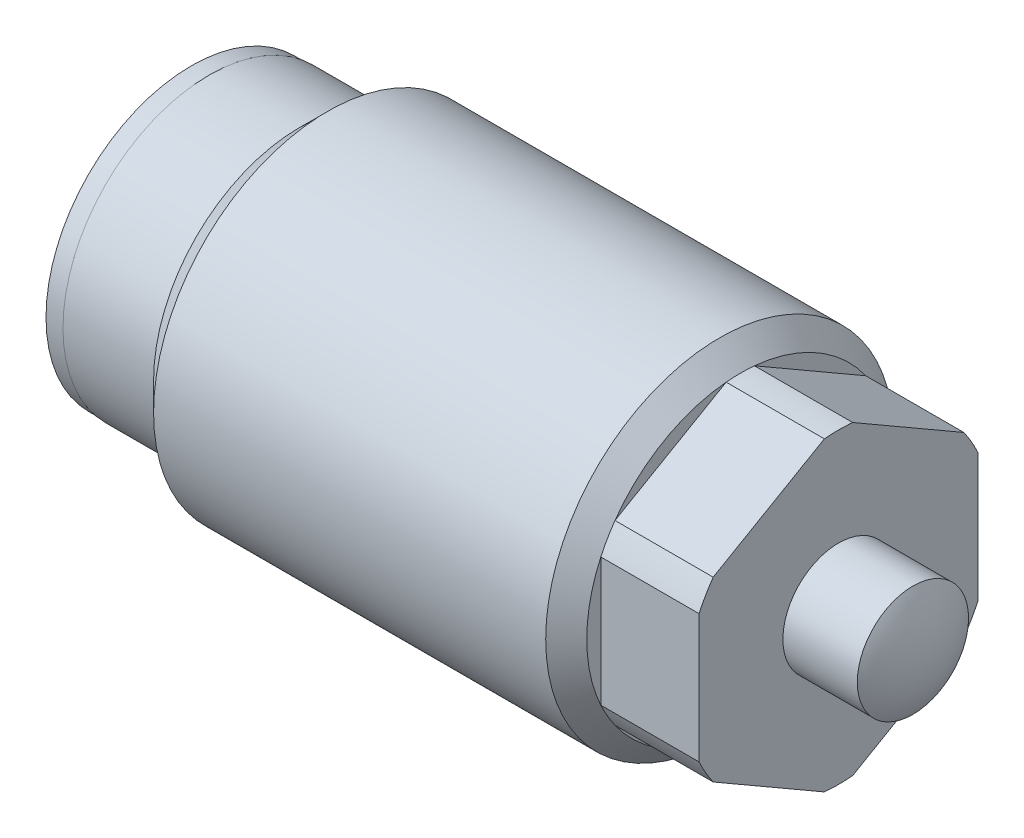
ISO-10303-21;
HEADER;
FILE_DESCRIPTION(('STEP AP214'),'2;1');
FILE_NAME('part.step','',(''),(''),'','','');
FILE_SCHEMA(('AUTOMOTIVE_DESIGN { 1 0 10303 214 1 1 1 1 }'));
ENDSEC;
DATA;
#1=APPLICATION_CONTEXT('core data for automotive mechanical design processes');
#2=APPLICATION_PROTOCOL_DEFINITION('international standard','automotive_design',2000,#1);
#3=PRODUCT_CONTEXT('',#1,'mechanical');
#4=PRODUCT('Part','Part','',(#3));
#5=PRODUCT_RELATED_PRODUCT_CATEGORY('part','',(#4));
#6=PRODUCT_DEFINITION_FORMATION('','',#4);
#7=PRODUCT_DEFINITION_CONTEXT('part definition',#1,'design');
#8=PRODUCT_DEFINITION('design','',#6,#7);
#9=PRODUCT_DEFINITION_SHAPE('','',#8);
#10=(LENGTH_UNIT() NAMED_UNIT(*) SI_UNIT(.MILLI.,.METRE.));
#11=(NAMED_UNIT(*) PLANE_ANGLE_UNIT() SI_UNIT($,.RADIAN.));
#12=(NAMED_UNIT(*) SI_UNIT($,.STERADIAN.) SOLID_ANGLE_UNIT());
#13=UNCERTAINTY_MEASURE_WITH_UNIT(LENGTH_MEASURE(1.E-05),#10,'distance_accuracy_value','');
#14=(GEOMETRIC_REPRESENTATION_CONTEXT(3) GLOBAL_UNCERTAINTY_ASSIGNED_CONTEXT((#13)) GLOBAL_UNIT_ASSIGNED_CONTEXT((#10,
#11,#12)) REPRESENTATION_CONTEXT('',''));
#15=CARTESIAN_POINT('',(0.,0.,0.));
#16=DIRECTION('',(0.,0.,1.));
#17=DIRECTION('',(1.,0.,0.));
#18=AXIS2_PLACEMENT_3D('',#15,#16,#17);
#19=CARTESIAN_POINT('',(30.226,9.906,0.));
#20=DIRECTION('',(1.,0.,0.));
#21=DIRECTION('',(0.,0.,-1.));
#22=AXIS2_PLACEMENT_3D('',#19,#20,#21);
#23=PLANE('',#22);
#24=DIRECTION('',(0.,-0.5,-0.866025403784439));
#25=VECTOR('',#24,1.);
#26=CARTESIAN_POINT('',(30.226,-4.58271776169266,7.9375));
#27=LINE('',#26,#25);
#28=CARTESIAN_POINT('',(30.226,-5.04775879574999,7.13202530140833));
#29=VERTEX_POINT('',#28);
#30=CARTESIAN_POINT('',(30.226,-8.70039448932798,0.805474698591668));
#31=VERTEX_POINT('',#30);
#32=EDGE_CURVE('E186',#29,#31,#27,.T.);
#33=ORIENTED_EDGE('',*,*,#32,.F.);
#34=CARTESIAN_POINT('',(30.226,0.,0.));
#35=DIRECTION('',(1.,0.,0.));
#36=DIRECTION('',(0.,0.,-1.));
#37=AXIS2_PLACEMENT_3D('',#34,#35,#36);
#38=CIRCLE('',#37,8.73759999999999);
#39=EDGE_CURVE('E12',#29,#31,#38,.T.);
#40=ORIENTED_EDGE('',*,*,#39,.T.);
#41=EDGE_LOOP('',(#33,#40));
#42=FACE_BOUND('',#41,.T.);
#43=ADVANCED_FACE('F41',(#42),#23,.T.);
#44=DIRECTION('',(0.,0.5,-0.866025403784439));
#45=VECTOR('',#44,1.);
#46=CARTESIAN_POINT('',(30.226,-9.16543552338531,0.));
#47=LINE('',#46,#45);
#48=CARTESIAN_POINT('',(30.226,-8.70039448932798,-0.805474698591672));
#49=VERTEX_POINT('',#48);
#50=CARTESIAN_POINT('',(30.226,-5.04775879574999,-7.13202530140833));
#51=VERTEX_POINT('',#50);
#52=EDGE_CURVE('E184',#49,#51,#47,.T.);
#53=ORIENTED_EDGE('',*,*,#52,.F.);
#54=CARTESIAN_POINT('',(30.226,0.,0.));
#55=DIRECTION('',(1.,0.,0.));
#56=DIRECTION('',(0.,0.,-1.));
#57=AXIS2_PLACEMENT_3D('',#54,#55,#56);
#58=CIRCLE('',#57,8.73759999999999);
#59=EDGE_CURVE('E49',#49,#51,#58,.T.);
#60=ORIENTED_EDGE('',*,*,#59,.T.);
#61=EDGE_LOOP('',(#53,#60));
#62=FACE_BOUND('',#61,.T.);
#63=ADVANCED_FACE('F285',(#62),#23,.T.);
#64=DIRECTION('',(0.,1.,0.));
#65=VECTOR('',#64,1.);
#66=CARTESIAN_POINT('',(30.226,-4.58271776169266,-7.9375));
#67=LINE('',#66,#65);
#68=CARTESIAN_POINT('',(30.226,-3.65263569357799,-7.9375));
#69=VERTEX_POINT('',#68);
#70=CARTESIAN_POINT('',(30.226,3.65263569357799,-7.9375));
#71=VERTEX_POINT('',#70);
#72=EDGE_CURVE('E144',#69,#71,#67,.T.);
#73=ORIENTED_EDGE('',*,*,#72,.F.);
#74=CARTESIAN_POINT('',(30.226,0.,0.));
#75=DIRECTION('',(1.,0.,0.));
#76=DIRECTION('',(0.,0.,-1.));
#77=AXIS2_PLACEMENT_3D('',#74,#75,#76);
#78=CIRCLE('',#77,8.73759999999999);
#79=EDGE_CURVE('E153',#69,#71,#78,.T.);
#80=ORIENTED_EDGE('',*,*,#79,.T.);
#81=EDGE_LOOP('',(#73,#80));
#82=FACE_BOUND('',#81,.T.);
#83=ADVANCED_FACE('F152',(#82),#23,.T.);
#84=DIRECTION('',(0.,0.5,0.866025403784438));
#85=VECTOR('',#84,1.);
#86=CARTESIAN_POINT('',(30.226,4.58271776169265,-7.9375));
#87=LINE('',#86,#85);
#88=CARTESIAN_POINT('',(30.226,5.04775879574999,-7.13202530140834));
#89=VERTEX_POINT('',#88);
#90=CARTESIAN_POINT('',(30.226,8.70039448932798,-0.805474698591672));
#91=VERTEX_POINT('',#90);
#92=EDGE_CURVE('E155',#89,#91,#87,.T.);
#93=ORIENTED_EDGE('',*,*,#92,.F.);
#94=CARTESIAN_POINT('',(30.226,0.,0.));
#95=DIRECTION('',(1.,0.,0.));
#96=DIRECTION('',(0.,0.,-1.));
#97=AXIS2_PLACEMENT_3D('',#94,#95,#96);
#98=CIRCLE('',#97,8.73759999999999);
#99=EDGE_CURVE('E160',#89,#91,#98,.T.);
#100=ORIENTED_EDGE('',*,*,#99,.T.);
#101=EDGE_LOOP('',(#93,#100));
#102=FACE_BOUND('',#101,.T.);
#103=ADVANCED_FACE('F327',(#102),#23,.T.);
#104=DIRECTION('',(0.,-0.5,0.866025403784439));
#105=VECTOR('',#104,1.);
#106=CARTESIAN_POINT('',(30.226,9.16543552338531,0.));
#107=LINE('',#106,#105);
#108=CARTESIAN_POINT('',(30.226,8.70039448932798,0.80547469859167));
#109=VERTEX_POINT('',#108);
#110=CARTESIAN_POINT('',(30.226,5.04775879574999,7.13202530140833));
#111=VERTEX_POINT('',#110);
#112=EDGE_CURVE('E192',#109,#111,#107,.T.);
#113=ORIENTED_EDGE('',*,*,#112,.F.);
#114=CARTESIAN_POINT('',(30.226,0.,0.));
#115=DIRECTION('',(1.,0.,0.));
#116=DIRECTION('',(0.,0.,-1.));
#117=AXIS2_PLACEMENT_3D('',#114,#115,#116);
#118=CIRCLE('',#117,8.73759999999999);
#119=EDGE_CURVE('E162',#109,#111,#118,.T.);
#120=ORIENTED_EDGE('',*,*,#119,.T.);
#121=EDGE_LOOP('',(#113,#120));
#122=FACE_BOUND('',#121,.T.);
#123=ADVANCED_FACE('F299',(#122),#23,.T.);
#124=CARTESIAN_POINT('',(35.814,13.748153285078,-7.9375));
#125=DIRECTION('',(1.,0.,0.));
#126=DIRECTION('',(0.,0.,-1.));
#127=AXIS2_PLACEMENT_3D('',#124,#125,#126);
#128=PLANE('',#127);
#129=CARTESIAN_POINT('',(35.814,0.,0.));
#130=DIRECTION('',(-1.,0.,0.));
#131=DIRECTION('',(0.,-1.,0.));
#132=AXIS2_PLACEMENT_3D('',#129,#130,#131);
#133=CIRCLE('',#132,3.16484);
#134=CARTESIAN_POINT('',(35.814,-3.16484,0.));
#135=VERTEX_POINT('',#134);
#136=EDGE_CURVE('E156',#135,#135,#133,.T.);
#137=ORIENTED_EDGE('',*,*,#136,.T.);
#138=EDGE_LOOP('',(#137));
#139=FACE_BOUND('',#138,.T.);
#140=DIRECTION('',(0.,1.,0.));
#141=VECTOR('',#140,1.);
#142=CARTESIAN_POINT('',(35.814,-4.58271776169266,-7.9375));
#143=LINE('',#142,#141);
#144=CARTESIAN_POINT('',(35.814,-3.65263569357799,-7.9375));
#145=VERTEX_POINT('',#144);
#146=CARTESIAN_POINT('',(35.814,3.65263569357799,-7.9375));
#147=VERTEX_POINT('',#146);
#148=EDGE_CURVE('E147',#145,#147,#143,.T.);
#149=ORIENTED_EDGE('',*,*,#148,.T.);
#150=CARTESIAN_POINT('',(35.814,0.,0.));
#151=DIRECTION('',(1.,0.,0.));
#152=DIRECTION('',(0.,0.,-1.));
#153=AXIS2_PLACEMENT_3D('',#150,#151,#152);
#154=CIRCLE('',#153,8.7376);
#155=CARTESIAN_POINT('',(35.814,5.04775879574999,-7.13202530140833));
#156=VERTEX_POINT('',#155);
#157=EDGE_CURVE('E242',#147,#156,#154,.T.);
#158=ORIENTED_EDGE('',*,*,#157,.T.);
#159=DIRECTION('',(0.,0.5,0.866025403784438));
#160=VECTOR('',#159,1.);
#161=CARTESIAN_POINT('',(35.814,4.58271776169265,-7.9375));
#162=LINE('',#161,#160);
#163=CARTESIAN_POINT('',(35.814,8.70039448932798,-0.805474698591675));
#164=VERTEX_POINT('',#163);
#165=EDGE_CURVE('E208',#156,#164,#162,.T.);
#166=ORIENTED_EDGE('',*,*,#165,.T.);
#167=CARTESIAN_POINT('',(35.814,8.70039448932798,0.805474698591674));
#168=VERTEX_POINT('',#167);
#169=EDGE_CURVE('E244',#164,#168,#154,.T.);
#170=ORIENTED_EDGE('',*,*,#169,.T.);
#171=DIRECTION('',(0.,-0.5,0.866025403784439));
#172=VECTOR('',#171,1.);
#173=CARTESIAN_POINT('',(35.814,9.16543552338531,0.));
#174=LINE('',#173,#172);
#175=CARTESIAN_POINT('',(35.814,5.04775879575,7.13202530140833));
#176=VERTEX_POINT('',#175);
#177=EDGE_CURVE('E205',#168,#176,#174,.T.);
#178=ORIENTED_EDGE('',*,*,#177,.T.);
#179=CARTESIAN_POINT('',(35.814,3.652635693578,7.9375));
#180=VERTEX_POINT('',#179);
#181=EDGE_CURVE('E250',#176,#180,#154,.T.);
#182=ORIENTED_EDGE('',*,*,#181,.T.);
#183=DIRECTION('',(0.,-1.,0.));
#184=VECTOR('',#183,1.);
#185=CARTESIAN_POINT('',(35.814,4.58271776169266,7.9375));
#186=LINE('',#185,#184);
#187=CARTESIAN_POINT('',(35.814,-3.65263569357799,7.9375));
#188=VERTEX_POINT('',#187);
#189=EDGE_CURVE('E202',#180,#188,#186,.T.);
#190=ORIENTED_EDGE('',*,*,#189,.T.);
#191=CARTESIAN_POINT('',(35.814,-5.04775879574999,7.13202530140834));
#192=VERTEX_POINT('',#191);
#193=EDGE_CURVE('E253',#188,#192,#154,.T.);
#194=ORIENTED_EDGE('',*,*,#193,.T.);
#195=DIRECTION('',(0.,-0.5,-0.866025403784439));
#196=VECTOR('',#195,1.);
#197=CARTESIAN_POINT('',(35.814,-4.58271776169266,7.9375));
#198=LINE('',#197,#196);
#199=CARTESIAN_POINT('',(35.814,-8.70039448932798,0.805474698591664));
#200=VERTEX_POINT('',#199);
#201=EDGE_CURVE('E199',#192,#200,#198,.T.);
#202=ORIENTED_EDGE('',*,*,#201,.T.);
#203=CARTESIAN_POINT('',(35.814,-8.70039448932798,-0.805474698591664));
#204=VERTEX_POINT('',#203);
#205=EDGE_CURVE('E251',#200,#204,#154,.T.);
#206=ORIENTED_EDGE('',*,*,#205,.T.);
#207=DIRECTION('',(0.,0.5,-0.866025403784439));
#208=VECTOR('',#207,1.);
#209=CARTESIAN_POINT('',(35.814,-9.16543552338531,0.));
#210=LINE('',#209,#208);
#211=CARTESIAN_POINT('',(35.814,-5.04775879574999,-7.13202530140834));
#212=VERTEX_POINT('',#211);
#213=EDGE_CURVE('E183',#204,#212,#210,.T.);
#214=ORIENTED_EDGE('',*,*,#213,.T.);
#215=EDGE_CURVE('E245',#212,#145,#154,.T.);
#216=ORIENTED_EDGE('',*,*,#215,.T.);
#217=EDGE_LOOP('',(#149,#158,#166,#170,#178,#182,#190,#194,#202,#206,#214,#216));
#218=FACE_BOUND('',#217,.T.);
#219=ADVANCED_FACE('F259',(#139,#218),#128,.T.);
#220=CARTESIAN_POINT('',(35.814,-4.58271776169266,-7.9375));
#221=DIRECTION('',(0.,0.,1.));
#222=DIRECTION('',(1.,0.,0.));
#223=AXIS2_PLACEMENT_3D('',#220,#221,#222);
#224=PLANE('',#223);
#225=DIRECTION('',(1.,0.,0.));
#226=VECTOR('',#225,1.);
#227=CARTESIAN_POINT('',(2.20760090226423,-3.65263569357799,-7.9375));
#228=LINE('',#227,#226);
#229=EDGE_CURVE('E62',#69,#145,#228,.T.);
#230=ORIENTED_EDGE('',*,*,#229,.F.);
#231=ORIENTED_EDGE('',*,*,#72,.T.);
#232=DIRECTION('',(1.,0.,0.));
#233=VECTOR('',#232,1.);
#234=CARTESIAN_POINT('',(2.20760090226423,3.65263569357799,-7.9375));
#235=LINE('',#234,#233);
#236=EDGE_CURVE('E149',#147,#71,#235,.F.);
#237=ORIENTED_EDGE('',*,*,#236,.F.);
#238=ORIENTED_EDGE('',*,*,#148,.F.);
#239=EDGE_LOOP('',(#230,#231,#237,#238));
#240=FACE_BOUND('',#239,.T.);
#241=ADVANCED_FACE('F142',(#240),#224,.F.);
#242=CARTESIAN_POINT('',(35.814,4.58271776169265,-7.9375));
#243=DIRECTION('',(0.,-0.866025403784439,0.5));
#244=DIRECTION('',(0.,-0.5,-0.866025403784439));
#245=AXIS2_PLACEMENT_3D('',#242,#243,#244);
#246=PLANE('',#245);
#247=DIRECTION('',(1.,0.,0.));
#248=VECTOR('',#247,1.);
#249=CARTESIAN_POINT('',(2.20760090226423,5.04775879574999,-7.13202530140833));
#250=LINE('',#249,#248);
#251=EDGE_CURVE('E223',#89,#156,#250,.T.);
#252=ORIENTED_EDGE('',*,*,#251,.F.);
#253=ORIENTED_EDGE('',*,*,#92,.T.);
#254=DIRECTION('',(1.,0.,0.));
#255=VECTOR('',#254,1.);
#256=CARTESIAN_POINT('',(2.20760090226423,8.70039448932798,-0.805474698591675));
#257=LINE('',#256,#255);
#258=EDGE_CURVE('E225',#164,#91,#257,.F.);
#259=ORIENTED_EDGE('',*,*,#258,.F.);
#260=ORIENTED_EDGE('',*,*,#165,.F.);
#261=EDGE_LOOP('',(#252,#253,#259,#260));
#262=FACE_BOUND('',#261,.T.);
#263=ADVANCED_FACE('F341',(#262),#246,.F.);
#264=CARTESIAN_POINT('',(35.814,9.16543552338531,0.));
#265=DIRECTION('',(0.,-0.866025403784439,-0.5));
#266=DIRECTION('',(0.,0.5,-0.866025403784439));
#267=AXIS2_PLACEMENT_3D('',#264,#265,#266);
#268=PLANE('',#267);
#269=DIRECTION('',(1.,0.,0.));
#270=VECTOR('',#269,1.);
#271=CARTESIAN_POINT('',(2.20760090226423,8.70039448932798,0.805474698591674));
#272=LINE('',#271,#270);
#273=EDGE_CURVE('E228',#109,#168,#272,.T.);
#274=ORIENTED_EDGE('',*,*,#273,.F.);
#275=ORIENTED_EDGE('',*,*,#112,.T.);
#276=DIRECTION('',(1.,0.,0.));
#277=VECTOR('',#276,1.);
#278=CARTESIAN_POINT('',(2.20760090226423,5.04775879575,7.13202530140833));
#279=LINE('',#278,#277);
#280=EDGE_CURVE('E230',#176,#111,#279,.F.);
#281=ORIENTED_EDGE('',*,*,#280,.F.);
#282=ORIENTED_EDGE('',*,*,#177,.F.);
#283=EDGE_LOOP('',(#274,#275,#281,#282));
#284=FACE_BOUND('',#283,.T.);
#285=ADVANCED_FACE('F297',(#284),#268,.F.);
#286=CARTESIAN_POINT('',(35.814,4.58271776169266,7.9375));
#287=DIRECTION('',(0.,0.,-1.));
#288=DIRECTION('',(0.,1.,0.));
#289=AXIS2_PLACEMENT_3D('',#286,#287,#288);
#290=PLANE('',#289);
#291=DIRECTION('',(1.,0.,0.));
#292=VECTOR('',#291,1.);
#293=CARTESIAN_POINT('',(2.20760090226423,3.652635693578,7.9375));
#294=LINE('',#293,#292);
#295=CARTESIAN_POINT('',(30.226,3.652635693578,7.9375));
#296=VERTEX_POINT('',#295);
#297=EDGE_CURVE('E233',#296,#180,#294,.T.);
#298=ORIENTED_EDGE('',*,*,#297,.F.);
#299=DIRECTION('',(0.,-1.,0.));
#300=VECTOR('',#299,1.);
#301=CARTESIAN_POINT('',(30.226,4.58271776169266,7.9375));
#302=LINE('',#301,#300);
#303=CARTESIAN_POINT('',(30.226,-3.65263569357799,7.9375));
#304=VERTEX_POINT('',#303);
#305=EDGE_CURVE('E189',#296,#304,#302,.T.);
#306=ORIENTED_EDGE('',*,*,#305,.T.);
#307=DIRECTION('',(1.,0.,0.));
#308=VECTOR('',#307,1.);
#309=CARTESIAN_POINT('',(2.20760090226423,-3.65263569357799,7.9375));
#310=LINE('',#309,#308);
#311=EDGE_CURVE('E235',#188,#304,#310,.F.);
#312=ORIENTED_EDGE('',*,*,#311,.F.);
#313=ORIENTED_EDGE('',*,*,#189,.F.);
#314=EDGE_LOOP('',(#298,#306,#312,#313));
#315=FACE_BOUND('',#314,.T.);
#316=ADVANCED_FACE('F266',(#315),#290,.F.);
#317=CARTESIAN_POINT('',(35.814,-4.58271776169266,7.9375));
#318=DIRECTION('',(0.,0.866025403784439,-0.5));
#319=DIRECTION('',(0.,0.5,0.866025403784439));
#320=AXIS2_PLACEMENT_3D('',#317,#318,#319);
#321=PLANE('',#320);
#322=DIRECTION('',(1.,0.,0.));
#323=VECTOR('',#322,1.);
#324=CARTESIAN_POINT('',(2.20760090226423,-5.04775879574998,7.13202530140833));
#325=LINE('',#324,#323);
#326=EDGE_CURVE('E238',#29,#192,#325,.T.);
#327=ORIENTED_EDGE('',*,*,#326,.F.);
#328=ORIENTED_EDGE('',*,*,#32,.T.);
#329=DIRECTION('',(1.,0.,0.));
#330=VECTOR('',#329,1.);
#331=CARTESIAN_POINT('',(2.20760090226423,-8.70039448932798,0.805474698591664));
#332=LINE('',#331,#330);
#333=EDGE_CURVE('E134',#200,#31,#332,.F.);
#334=ORIENTED_EDGE('',*,*,#333,.F.);
#335=ORIENTED_EDGE('',*,*,#201,.F.);
#336=EDGE_LOOP('',(#327,#328,#334,#335));
#337=FACE_BOUND('',#336,.T.);
#338=ADVANCED_FACE('F276',(#337),#321,.F.);
#339=CARTESIAN_POINT('',(35.814,-9.16543552338531,0.));
#340=DIRECTION('',(0.,0.866025403784439,0.5));
#341=DIRECTION('',(0.,-0.5,0.866025403784439));
#342=AXIS2_PLACEMENT_3D('',#339,#340,#341);
#343=PLANE('',#342);
#344=DIRECTION('',(1.,0.,0.));
#345=VECTOR('',#344,1.);
#346=CARTESIAN_POINT('',(2.20760090226423,-8.70039448932798,-0.805474698591664));
#347=LINE('',#346,#345);
#348=EDGE_CURVE('E171',#49,#204,#347,.T.);
#349=ORIENTED_EDGE('',*,*,#348,.F.);
#350=ORIENTED_EDGE('',*,*,#52,.T.);
#351=DIRECTION('',(1.,0.,0.));
#352=VECTOR('',#351,1.);
#353=CARTESIAN_POINT('',(2.20760090226423,-5.04775879574998,-7.13202530140833));
#354=LINE('',#353,#352);
#355=EDGE_CURVE('E130',#212,#51,#354,.F.);
#356=ORIENTED_EDGE('',*,*,#355,.F.);
#357=ORIENTED_EDGE('',*,*,#213,.F.);
#358=EDGE_LOOP('',(#349,#350,#356,#357));
#359=FACE_BOUND('',#358,.T.);
#360=ADVANCED_FACE('F284',(#359),#343,.F.);
#361=ORIENTED_EDGE('',*,*,#305,.F.);
#362=CARTESIAN_POINT('',(30.226,0.,0.));
#363=DIRECTION('',(1.,0.,0.));
#364=DIRECTION('',(0.,0.,-1.));
#365=AXIS2_PLACEMENT_3D('',#362,#363,#364);
#366=CIRCLE('',#365,8.73759999999999);
#367=EDGE_CURVE('E166',#296,#304,#366,.T.);
#368=ORIENTED_EDGE('',*,*,#367,.T.);
#369=EDGE_LOOP('',(#361,#368));
#370=FACE_BOUND('',#369,.T.);
#371=ADVANCED_FACE('F311',(#370),#23,.T.);
#372=CARTESIAN_POINT('',(30.6025425410263,0.,0.));
#373=DIRECTION('',(-1.,0.,0.));
#374=DIRECTION('',(0.,0.,1.));
#375=AXIS2_PLACEMENT_3D('',#372,#373,#374);
#376=CYLINDRICAL_SURFACE('',#375,9.906);
#377=CARTESIAN_POINT('',(29.0576,0.,0.));
#378=DIRECTION('',(1.,0.,0.));
#379=DIRECTION('',(0.,0.,-1.));
#380=AXIS2_PLACEMENT_3D('',#377,#378,#379);
#381=CIRCLE('',#380,9.906);
#382=CARTESIAN_POINT('',(29.0576,0.,-9.906));
#383=VERTEX_POINT('',#382);
#384=EDGE_CURVE('E168',#383,#383,#381,.F.);
#385=ORIENTED_EDGE('',*,*,#384,.T.);
#386=EDGE_LOOP('',(#385));
#387=FACE_BOUND('',#386,.T.);
#388=CARTESIAN_POINT('',(6.74369999999998,0.,0.));
#389=DIRECTION('',(-1.,0.,0.));
#390=DIRECTION('',(0.,0.,1.));
#391=AXIS2_PLACEMENT_3D('',#388,#389,#390);
#392=CIRCLE('',#391,9.906);
#393=CARTESIAN_POINT('',(6.74369999999998,0.,9.906));
#394=VERTEX_POINT('',#393);
#395=EDGE_CURVE('E180',#394,#394,#392,.T.);
#396=ORIENTED_EDGE('',*,*,#395,.F.);
#397=EDGE_LOOP('',(#396));
#398=FACE_BOUND('',#397,.T.);
#399=ADVANCED_FACE('F317',(#387,#398),#376,.T.);
#400=CARTESIAN_POINT('',(0.,0.,0.));
#401=DIRECTION('',(-1.,0.,0.));
#402=DIRECTION('',(0.,0.,1.));
#403=AXIS2_PLACEMENT_3D('',#400,#401,#402);
#404=PLANE('',#403);
#405=CARTESIAN_POINT('',(0.,0.,0.));
#406=DIRECTION('',(-1.,0.,0.));
#407=DIRECTION('',(0.,0.,1.));
#408=AXIS2_PLACEMENT_3D('',#405,#406,#407);
#409=CIRCLE('',#408,3.96240000000001);
#410=CARTESIAN_POINT('',(0.,0.,3.96240000000001));
#411=VERTEX_POINT('',#410);
#412=EDGE_CURVE('E148',#411,#411,#409,.T.);
#413=ORIENTED_EDGE('',*,*,#412,.F.);
#414=EDGE_LOOP('',(#413));
#415=FACE_BOUND('',#414,.T.);
#416=CARTESIAN_POINT('',(0.,0.,0.));
#417=DIRECTION('',(-1.,0.,0.));
#418=DIRECTION('',(0.,0.,1.));
#419=AXIS2_PLACEMENT_3D('',#416,#417,#418);
#420=CIRCLE('',#419,8.3185);
#421=CARTESIAN_POINT('',(0.,0.,8.3185));
#422=VERTEX_POINT('',#421);
#423=EDGE_CURVE('E174',#422,#422,#420,.T.);
#424=ORIENTED_EDGE('',*,*,#423,.T.);
#425=EDGE_LOOP('',(#424));
#426=FACE_BOUND('',#425,.T.);
#427=ADVANCED_FACE('F323',(#415,#426),#404,.T.);
#428=CARTESIAN_POINT('',(30.6025425410263,0.,0.));
#429=DIRECTION('',(-1.,0.,0.));
#430=DIRECTION('',(0.,0.,1.));
#431=AXIS2_PLACEMENT_3D('',#428,#429,#430);
#432=CYLINDRICAL_SURFACE('',#431,8.3185);
#433=CARTESIAN_POINT('',(5.1562,0.,0.));
#434=DIRECTION('',(-1.,0.,0.));
#435=DIRECTION('',(0.,0.,1.));
#436=AXIS2_PLACEMENT_3D('',#433,#434,#435);
#437=CIRCLE('',#436,8.3185);
#438=CARTESIAN_POINT('',(5.1562,0.,8.3185));
#439=VERTEX_POINT('',#438);
#440=EDGE_CURVE('E177',#439,#439,#437,.T.);
#441=ORIENTED_EDGE('',*,*,#440,.T.);
#442=EDGE_LOOP('',(#441));
#443=FACE_BOUND('',#442,.T.);
#444=ORIENTED_EDGE('',*,*,#423,.F.);
#445=EDGE_LOOP('',(#444));
#446=FACE_BOUND('',#445,.T.);
#447=ADVANCED_FACE('F384',(#443,#446),#432,.T.);
#448=CARTESIAN_POINT('',(5.1562,0.,0.));
#449=DIRECTION('',(1.,0.,0.));
#450=DIRECTION('',(0.,0.,-1.));
#451=AXIS2_PLACEMENT_3D('',#448,#449,#450);
#452=CONICAL_SURFACE('',#451,8.3185,0.785398163397452);
#453=ORIENTED_EDGE('',*,*,#395,.T.);
#454=EDGE_LOOP('',(#453));
#455=FACE_BOUND('',#454,.T.);
#456=ORIENTED_EDGE('',*,*,#440,.F.);
#457=EDGE_LOOP('',(#456));
#458=FACE_BOUND('',#457,.T.);
#459=ADVANCED_FACE('F369',(#455,#458),#452,.T.);
#460=CARTESIAN_POINT('',(35.814,0.,0.));
#461=DIRECTION('',(-1.,0.,0.));
#462=DIRECTION('',(0.,-1.,0.));
#463=AXIS2_PLACEMENT_3D('',#460,#461,#462);
#464=CYLINDRICAL_SURFACE('',#463,3.16484);
#465=ORIENTED_EDGE('',*,*,#136,.F.);
#466=EDGE_LOOP('',(#465));
#467=FACE_BOUND('',#466,.T.);
#468=CARTESIAN_POINT('',(40.0491146922112,0.,0.));
#469=DIRECTION('',(-1.,0.,0.));
#470=DIRECTION('',(0.,-1.,0.));
#471=AXIS2_PLACEMENT_3D('',#468,#469,#470);
#472=CIRCLE('',#471,3.16484);
#473=CARTESIAN_POINT('',(40.0491146922112,-3.16484,0.));
#474=VERTEX_POINT('',#473);
#475=EDGE_CURVE('E214',#474,#474,#472,.T.);
#476=ORIENTED_EDGE('',*,*,#475,.T.);
#477=EDGE_LOOP('',(#476));
#478=FACE_BOUND('',#477,.T.);
#479=ADVANCED_FACE('F366',(#467,#478),#464,.T.);
#480=CARTESIAN_POINT('',(34.544,0.,0.));
#481=DIRECTION('',(-1.,0.,0.));
#482=DIRECTION('',(0.,1.,0.));
#483=AXIS2_PLACEMENT_3D('',#480,#481,#482);
#484=SPHERICAL_SURFACE('',#483,6.35);
#485=ORIENTED_EDGE('',*,*,#475,.F.);
#486=EDGE_LOOP('',(#485));
#487=FACE_BOUND('',#486,.T.);
#488=ADVANCED_FACE('F358',(#487),#484,.T.);
#489=CARTESIAN_POINT('',(1.016,0.,0.));
#490=DIRECTION('',(1.,0.,0.));
#491=DIRECTION('',(0.,0.,-1.));
#492=AXIS2_PLACEMENT_3D('',#489,#490,#491);
#493=PLANE('',#492);
#494=CARTESIAN_POINT('',(1.016,0.,0.));
#495=DIRECTION('',(-1.,0.,0.));
#496=DIRECTION('',(0.,0.,1.));
#497=AXIS2_PLACEMENT_3D('',#494,#495,#496);
#498=CIRCLE('',#497,3.96240000000001);
#499=CARTESIAN_POINT('',(1.016,0.,3.96240000000001));
#500=VERTEX_POINT('',#499);
#501=EDGE_CURVE('E217',#500,#500,#498,.T.);
#502=ORIENTED_EDGE('',*,*,#501,.T.);
#503=EDGE_LOOP('',(#502));
#504=FACE_BOUND('',#503,.T.);
#505=ADVANCED_FACE('F353',(#504),#493,.F.);
#506=CARTESIAN_POINT('',(0.,0.,0.));
#507=DIRECTION('',(-1.,0.,0.));
#508=DIRECTION('',(0.,0.,1.));
#509=AXIS2_PLACEMENT_3D('',#506,#507,#508);
#510=CYLINDRICAL_SURFACE('',#509,3.96240000000001);
#511=ORIENTED_EDGE('',*,*,#501,.F.);
#512=EDGE_LOOP('',(#511));
#513=FACE_BOUND('',#512,.T.);
#514=ORIENTED_EDGE('',*,*,#412,.T.);
#515=EDGE_LOOP('',(#514));
#516=FACE_BOUND('',#515,.T.);
#517=ADVANCED_FACE('F348',(#513,#516),#510,.F.);
#518=CARTESIAN_POINT('',(2.20760090226423,0.,0.));
#519=DIRECTION('',(1.,0.,0.));
#520=DIRECTION('',(0.,0.,-1.));
#521=AXIS2_PLACEMENT_3D('',#518,#519,#520);
#522=CYLINDRICAL_SURFACE('',#521,8.7376);
#523=ORIENTED_EDGE('',*,*,#229,.T.);
#524=ORIENTED_EDGE('',*,*,#215,.F.);
#525=ORIENTED_EDGE('',*,*,#355,.T.);
#526=CARTESIAN_POINT('',(30.226,0.,0.));
#527=DIRECTION('',(1.,0.,0.));
#528=DIRECTION('',(0.,0.,-1.));
#529=AXIS2_PLACEMENT_3D('',#526,#527,#528);
#530=CIRCLE('',#529,8.7376);
#531=EDGE_CURVE('E127',#69,#51,#530,.F.);
#532=ORIENTED_EDGE('',*,*,#531,.F.);
#533=EDGE_LOOP('',(#523,#524,#525,#532));
#534=FACE_BOUND('',#533,.T.);
#535=ADVANCED_FACE('F128',(#534),#522,.T.);
#536=ORIENTED_EDGE('',*,*,#333,.T.);
#537=EDGE_CURVE('E135',#49,#31,#530,.F.);
#538=ORIENTED_EDGE('',*,*,#537,.F.);
#539=ORIENTED_EDGE('',*,*,#348,.T.);
#540=ORIENTED_EDGE('',*,*,#205,.F.);
#541=EDGE_LOOP('',(#536,#538,#539,#540));
#542=FACE_BOUND('',#541,.T.);
#543=ADVANCED_FACE('F281',(#542),#522,.T.);
#544=ORIENTED_EDGE('',*,*,#311,.T.);
#545=EDGE_CURVE('E272',#29,#304,#530,.F.);
#546=ORIENTED_EDGE('',*,*,#545,.F.);
#547=ORIENTED_EDGE('',*,*,#326,.T.);
#548=ORIENTED_EDGE('',*,*,#193,.F.);
#549=EDGE_LOOP('',(#544,#546,#547,#548));
#550=FACE_BOUND('',#549,.T.);
#551=ADVANCED_FACE('F271',(#550),#522,.T.);
#552=ORIENTED_EDGE('',*,*,#280,.T.);
#553=EDGE_CURVE('E286',#296,#111,#530,.F.);
#554=ORIENTED_EDGE('',*,*,#553,.F.);
#555=ORIENTED_EDGE('',*,*,#297,.T.);
#556=ORIENTED_EDGE('',*,*,#181,.F.);
#557=EDGE_LOOP('',(#552,#554,#555,#556));
#558=FACE_BOUND('',#557,.T.);
#559=ADVANCED_FACE('F300',(#558),#522,.T.);
#560=ORIENTED_EDGE('',*,*,#258,.T.);
#561=EDGE_CURVE('E248',#109,#91,#530,.F.);
#562=ORIENTED_EDGE('',*,*,#561,.F.);
#563=ORIENTED_EDGE('',*,*,#273,.T.);
#564=ORIENTED_EDGE('',*,*,#169,.F.);
#565=EDGE_LOOP('',(#560,#562,#563,#564));
#566=FACE_BOUND('',#565,.T.);
#567=ADVANCED_FACE('F293',(#566),#522,.T.);
#568=ORIENTED_EDGE('',*,*,#236,.T.);
#569=EDGE_CURVE('E137',#89,#71,#530,.F.);
#570=ORIENTED_EDGE('',*,*,#569,.F.);
#571=ORIENTED_EDGE('',*,*,#251,.T.);
#572=ORIENTED_EDGE('',*,*,#157,.F.);
#573=EDGE_LOOP('',(#568,#570,#571,#572));
#574=FACE_BOUND('',#573,.T.);
#575=ADVANCED_FACE('F307',(#574),#522,.T.);
#576=CARTESIAN_POINT('',(29.0576,0.,0.));
#577=DIRECTION('',(-1.,0.,0.));
#578=DIRECTION('',(0.,0.,1.));
#579=AXIS2_PLACEMENT_3D('',#576,#577,#578);
#580=CONICAL_SURFACE('',#579,9.906,0.78539816339745);
#581=ORIENTED_EDGE('',*,*,#39,.F.);
#582=ORIENTED_EDGE('',*,*,#545,.T.);
#583=ORIENTED_EDGE('',*,*,#367,.F.);
#584=ORIENTED_EDGE('',*,*,#553,.T.);
#585=ORIENTED_EDGE('',*,*,#119,.F.);
#586=ORIENTED_EDGE('',*,*,#561,.T.);
#587=ORIENTED_EDGE('',*,*,#99,.F.);
#588=ORIENTED_EDGE('',*,*,#569,.T.);
#589=ORIENTED_EDGE('',*,*,#79,.F.);
#590=ORIENTED_EDGE('',*,*,#531,.T.);
#591=ORIENTED_EDGE('',*,*,#59,.F.);
#592=ORIENTED_EDGE('',*,*,#537,.T.);
#593=EDGE_LOOP('',(#581,#582,#583,#584,#585,#586,#587,#588,#589,#590,#591,#592));
#594=FACE_BOUND('',#593,.T.);
#595=ORIENTED_EDGE('',*,*,#384,.F.);
#596=EDGE_LOOP('',(#595));
#597=FACE_BOUND('',#596,.T.);
#598=ADVANCED_FACE('F43',(#594,#597),#580,.T.);
#599=CLOSED_SHELL('',(#43,#63,#83,#103,#123,#219,#241,#263,#285,#316,#338,#360,#371,#399,#427,
#447,#459,#479,#488,#505,#517,#535,#543,#551,#559,#567,#575,#598));
#600=MANIFOLD_SOLID_BREP('B2',#599);
#601=CARTESIAN_POINT('',(-0.0254000000000029,5.7404,0.));
#602=DIRECTION('',(1.,0.,0.));
#603=DIRECTION('',(0.,0.,-1.));
#604=AXIS2_PLACEMENT_3D('',#601,#602,#603);
#605=PLANE('',#604);
#606=CARTESIAN_POINT('',(-0.0254000000000034,0.,0.));
#607=DIRECTION('',(1.,0.,0.));
#608=DIRECTION('',(0.,0.,-1.));
#609=AXIS2_PLACEMENT_3D('',#606,#607,#608);
#610=CIRCLE('',#609,8.2677);
#611=CARTESIAN_POINT('',(-0.0254000000000034,0.,-8.2677));
#612=VERTEX_POINT('',#611);
#613=EDGE_CURVE('E40',#612,#612,#610,.T.);
#614=ORIENTED_EDGE('',*,*,#613,.T.);
#615=EDGE_LOOP('',(#614));
#616=FACE_BOUND('',#615,.T.);
#617=CARTESIAN_POINT('',(-0.0254000000000024,0.,0.));
#618=DIRECTION('',(1.,0.,0.));
#619=DIRECTION('',(0.,0.,-1.));
#620=AXIS2_PLACEMENT_3D('',#617,#618,#619);
#621=CIRCLE('',#620,5.7404);
#622=CARTESIAN_POINT('',(-0.0254000000000024,0.,-5.7404));
#623=VERTEX_POINT('',#622);
#624=EDGE_CURVE('E589',#623,#623,#621,.T.);
#625=ORIENTED_EDGE('',*,*,#624,.F.);
#626=EDGE_LOOP('',(#625));
#627=FACE_BOUND('',#626,.T.);
#628=ADVANCED_FACE('F575',(#616,#627),#605,.T.);
#629=CARTESIAN_POINT('',(-0.762,0.,0.));
#630=DIRECTION('',(1.,0.,0.));
#631=DIRECTION('',(0.,0.,-1.));
#632=AXIS2_PLACEMENT_3D('',#629,#630,#631);
#633=CYLINDRICAL_SURFACE('',#632,8.2677);
#634=CARTESIAN_POINT('',(-1.016,0.,0.));
#635=DIRECTION('',(1.,0.,0.));
#636=DIRECTION('',(0.,0.,-1.));
#637=AXIS2_PLACEMENT_3D('',#634,#635,#636);
#638=CIRCLE('',#637,8.2677);
#639=CARTESIAN_POINT('',(-1.016,0.,-8.2677));
#640=VERTEX_POINT('',#639);
#641=EDGE_CURVE('E581',#640,#640,#638,.T.);
#642=ORIENTED_EDGE('',*,*,#641,.T.);
#643=EDGE_LOOP('',(#642));
#644=FACE_BOUND('',#643,.T.);
#645=ORIENTED_EDGE('',*,*,#613,.F.);
#646=EDGE_LOOP('',(#645));
#647=FACE_BOUND('',#646,.T.);
#648=ADVANCED_FACE('F599',(#644,#647),#633,.T.);
#649=CARTESIAN_POINT('',(-1.016,8.2677,0.));
#650=DIRECTION('',(-1.,0.,0.));
#651=DIRECTION('',(0.,0.,1.));
#652=AXIS2_PLACEMENT_3D('',#649,#650,#651);
#653=PLANE('',#652);
#654=CARTESIAN_POINT('',(-1.016,0.,0.));
#655=DIRECTION('',(1.,0.,0.));
#656=DIRECTION('',(0.,0.,-1.));
#657=AXIS2_PLACEMENT_3D('',#654,#655,#656);
#658=CIRCLE('',#657,5.7404);
#659=CARTESIAN_POINT('',(-1.016,0.,-5.7404));
#660=VERTEX_POINT('',#659);
#661=EDGE_CURVE('E585',#660,#660,#658,.T.);
#662=ORIENTED_EDGE('',*,*,#661,.T.);
#663=EDGE_LOOP('',(#662));
#664=FACE_BOUND('',#663,.T.);
#665=ORIENTED_EDGE('',*,*,#641,.F.);
#666=EDGE_LOOP('',(#665));
#667=FACE_BOUND('',#666,.T.);
#668=ADVANCED_FACE('F603',(#664,#667),#653,.T.);
#669=CARTESIAN_POINT('',(-0.762,0.,0.));
#670=DIRECTION('',(1.,0.,0.));
#671=DIRECTION('',(0.,0.,-1.));
#672=AXIS2_PLACEMENT_3D('',#669,#670,#671);
#673=CYLINDRICAL_SURFACE('',#672,5.7404);
#674=ORIENTED_EDGE('',*,*,#624,.T.);
#675=EDGE_LOOP('',(#674));
#676=FACE_BOUND('',#675,.T.);
#677=ORIENTED_EDGE('',*,*,#661,.F.);
#678=EDGE_LOOP('',(#677));
#679=FACE_BOUND('',#678,.T.);
#680=ADVANCED_FACE('F595',(#676,#679),#673,.F.);
#681=CLOSED_SHELL('',(#628,#648,#668,#680));
#682=MANIFOLD_SOLID_BREP('B6',#681);
#683=ADVANCED_BREP_SHAPE_REPRESENTATION('',(#18,#600,#682),#14);
#684=SHAPE_DEFINITION_REPRESENTATION(#9,#683);
ENDSEC;
END-ISO-10303-21;
